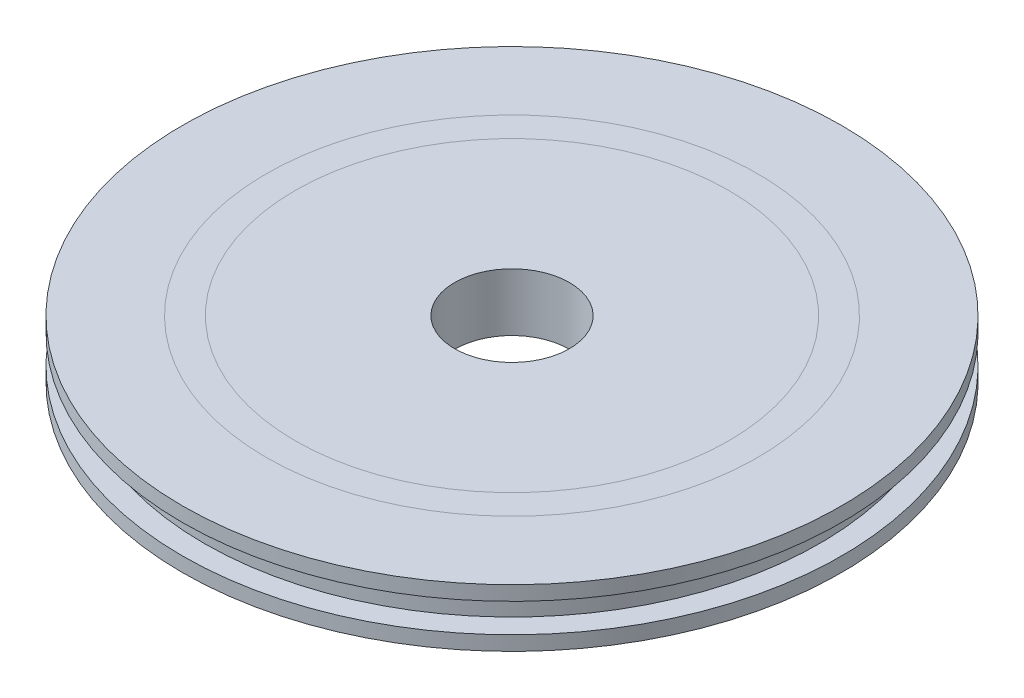
ISO-10303-21;
HEADER;
FILE_DESCRIPTION(('STEP AP214'),'2;1');
FILE_NAME('part.step','',(''),(''),'','','');
FILE_SCHEMA(('AUTOMOTIVE_DESIGN { 1 0 10303 214 1 1 1 1 }'));
ENDSEC;
DATA;
#1=APPLICATION_CONTEXT('core data for automotive mechanical design processes');
#2=APPLICATION_PROTOCOL_DEFINITION('international standard','automotive_design',2000,#1);
#3=PRODUCT_CONTEXT('',#1,'mechanical');
#4=PRODUCT('Part','Part','',(#3));
#5=PRODUCT_RELATED_PRODUCT_CATEGORY('part','',(#4));
#6=PRODUCT_DEFINITION_FORMATION('','',#4);
#7=PRODUCT_DEFINITION_CONTEXT('part definition',#1,'design');
#8=PRODUCT_DEFINITION('design','',#6,#7);
#9=PRODUCT_DEFINITION_SHAPE('','',#8);
#10=(LENGTH_UNIT() NAMED_UNIT(*) SI_UNIT(.MILLI.,.METRE.));
#11=(NAMED_UNIT(*) PLANE_ANGLE_UNIT() SI_UNIT($,.RADIAN.));
#12=(NAMED_UNIT(*) SI_UNIT($,.STERADIAN.) SOLID_ANGLE_UNIT());
#13=UNCERTAINTY_MEASURE_WITH_UNIT(LENGTH_MEASURE(1.E-05),#10,'distance_accuracy_value','');
#14=(GEOMETRIC_REPRESENTATION_CONTEXT(3) GLOBAL_UNCERTAINTY_ASSIGNED_CONTEXT((#13)) GLOBAL_UNIT_ASSIGNED_CONTEXT((#10,
#11,#12)) REPRESENTATION_CONTEXT('',''));
#15=CARTESIAN_POINT('',(0.,0.,0.));
#16=DIRECTION('',(0.,0.,1.));
#17=DIRECTION('',(1.,0.,0.));
#18=AXIS2_PLACEMENT_3D('',#15,#16,#17);
#19=CARTESIAN_POINT('',(0.,0.,28.956));
#20=DIRECTION('',(0.,1.,0.));
#21=DIRECTION('',(0.,0.,1.));
#22=AXIS2_PLACEMENT_3D('',#19,#20,#21);
#23=PLANE('',#22);
#24=CARTESIAN_POINT('',(0.,0.,0.));
#25=DIRECTION('',(0.,1.,0.));
#26=DIRECTION('',(0.,0.,1.));
#27=AXIS2_PLACEMENT_3D('',#24,#25,#26);
#28=CIRCLE('',#27,28.956);
#29=CARTESIAN_POINT('',(0.,0.,28.956));
#30=VERTEX_POINT('',#29);
#31=EDGE_CURVE('E85',#30,#30,#28,.T.);
#32=ORIENTED_EDGE('',*,*,#31,.T.);
#33=EDGE_LOOP('',(#32));
#34=FACE_BOUND('',#33,.T.);
#35=CARTESIAN_POINT('',(0.,0.,0.));
#36=DIRECTION('',(0.,1.,0.));
#37=DIRECTION('',(0.,0.,1.));
#38=AXIS2_PLACEMENT_3D('',#35,#36,#37);
#39=CIRCLE('',#38,21.59);
#40=CARTESIAN_POINT('',(0.,0.,21.59));
#41=VERTEX_POINT('',#40);
#42=EDGE_CURVE('E10',#41,#41,#39,.F.);
#43=ORIENTED_EDGE('',*,*,#42,.T.);
#44=EDGE_LOOP('',(#43));
#45=FACE_BOUND('',#44,.T.);
#46=ADVANCED_FACE('F45',(#34,#45),#23,.T.);
#47=ORIENTED_EDGE('',*,*,#42,.F.);
#48=EDGE_LOOP('',(#47));
#49=FACE_BOUND('',#48,.T.);
#50=CARTESIAN_POINT('',(0.,0.,0.));
#51=DIRECTION('',(0.,1.,0.));
#52=DIRECTION('',(0.,0.,1.));
#53=AXIS2_PLACEMENT_3D('',#50,#51,#52);
#54=CIRCLE('',#53,19.05);
#55=CARTESIAN_POINT('',(0.,0.,19.05));
#56=VERTEX_POINT('',#55);
#57=EDGE_CURVE('E53',#56,#56,#54,.F.);
#58=ORIENTED_EDGE('',*,*,#57,.T.);
#59=EDGE_LOOP('',(#58));
#60=FACE_BOUND('',#59,.T.);
#61=ADVANCED_FACE('F144',(#49,#60),#23,.T.);
#62=CARTESIAN_POINT('',(0.,0.,0.));
#63=DIRECTION('',(0.,-1.,0.));
#64=DIRECTION('',(0.,0.,-1.));
#65=AXIS2_PLACEMENT_3D('',#62,#63,#64);
#66=CIRCLE('',#65,5.0419);
#67=CARTESIAN_POINT('',(0.,0.,-5.0419));
#68=VERTEX_POINT('',#67);
#69=EDGE_CURVE('E89',#68,#68,#66,.T.);
#70=ORIENTED_EDGE('',*,*,#69,.T.);
#71=EDGE_LOOP('',(#70));
#72=FACE_BOUND('',#71,.T.);
#73=ORIENTED_EDGE('',*,*,#57,.F.);
#74=EDGE_LOOP('',(#73));
#75=FACE_BOUND('',#74,.T.);
#76=ADVANCED_FACE('F47',(#72,#75),#23,.T.);
#77=CARTESIAN_POINT('',(0.,-5.08,0.));
#78=DIRECTION('',(0.,-1.,0.));
#79=DIRECTION('',(0.,0.,-1.));
#80=AXIS2_PLACEMENT_3D('',#77,#78,#79);
#81=PLANE('',#80);
#82=CARTESIAN_POINT('',(0.,-5.08,0.));
#83=DIRECTION('',(0.,-1.,0.));
#84=DIRECTION('',(0.,0.,-1.));
#85=AXIS2_PLACEMENT_3D('',#82,#83,#84);
#86=CIRCLE('',#85,5.0419);
#87=CARTESIAN_POINT('',(0.,-5.08,-5.0419));
#88=VERTEX_POINT('',#87);
#89=EDGE_CURVE('E90',#88,#88,#86,.T.);
#90=ORIENTED_EDGE('',*,*,#89,.F.);
#91=EDGE_LOOP('',(#90));
#92=FACE_BOUND('',#91,.T.);
#93=CARTESIAN_POINT('',(0.,-5.08,0.));
#94=DIRECTION('',(0.,1.,0.));
#95=DIRECTION('',(0.,0.,1.));
#96=AXIS2_PLACEMENT_3D('',#93,#94,#95);
#97=CIRCLE('',#96,28.956);
#98=CARTESIAN_POINT('',(0.,-5.08,28.956));
#99=VERTEX_POINT('',#98);
#100=EDGE_CURVE('E60',#99,#99,#97,.T.);
#101=ORIENTED_EDGE('',*,*,#100,.F.);
#102=EDGE_LOOP('',(#101));
#103=FACE_BOUND('',#102,.T.);
#104=ADVANCED_FACE('F109',(#92,#103),#81,.T.);
#105=CARTESIAN_POINT('',(0.,0.,0.));
#106=DIRECTION('',(0.,1.,0.));
#107=DIRECTION('',(0.,0.,1.));
#108=AXIS2_PLACEMENT_3D('',#105,#106,#107);
#109=CYLINDRICAL_SURFACE('',#108,28.9559999999895);
#110=ORIENTED_EDGE('',*,*,#100,.T.);
#111=EDGE_LOOP('',(#110));
#112=FACE_BOUND('',#111,.T.);
#113=CARTESIAN_POINT('',(0.,-3.81,0.));
#114=DIRECTION('',(0.,1.,0.));
#115=DIRECTION('',(0.,0.,1.));
#116=AXIS2_PLACEMENT_3D('',#113,#114,#115);
#117=CIRCLE('',#116,28.9559999999791);
#118=CARTESIAN_POINT('',(0.,-3.81,28.9559999999791));
#119=VERTEX_POINT('',#118);
#120=EDGE_CURVE('E67',#119,#119,#117,.T.);
#121=ORIENTED_EDGE('',*,*,#120,.F.);
#122=EDGE_LOOP('',(#121));
#123=FACE_BOUND('',#122,.T.);
#124=ADVANCED_FACE('F112',(#112,#123),#109,.T.);
#125=CARTESIAN_POINT('',(0.,-3.81,28.9559999999791));
#126=DIRECTION('',(0.,1.,0.));
#127=DIRECTION('',(0.,0.,1.));
#128=AXIS2_PLACEMENT_3D('',#125,#126,#127);
#129=PLANE('',#128);
#130=ORIENTED_EDGE('',*,*,#120,.T.);
#131=EDGE_LOOP('',(#130));
#132=FACE_BOUND('',#131,.T.);
#133=CARTESIAN_POINT('',(0.,-3.81,0.));
#134=DIRECTION('',(0.,1.,0.));
#135=DIRECTION('',(0.,0.,1.));
#136=AXIS2_PLACEMENT_3D('',#133,#134,#135);
#137=CIRCLE('',#136,27.051);
#138=CARTESIAN_POINT('',(0.,-3.81,27.051));
#139=VERTEX_POINT('',#138);
#140=EDGE_CURVE('E73',#139,#139,#137,.T.);
#141=ORIENTED_EDGE('',*,*,#140,.F.);
#142=EDGE_LOOP('',(#141));
#143=FACE_BOUND('',#142,.T.);
#144=ADVANCED_FACE('F117',(#132,#143),#129,.T.);
#145=CARTESIAN_POINT('',(0.,0.,0.));
#146=DIRECTION('',(0.,1.,0.));
#147=DIRECTION('',(0.,0.,1.));
#148=AXIS2_PLACEMENT_3D('',#145,#146,#147);
#149=CYLINDRICAL_SURFACE('',#148,27.051);
#150=ORIENTED_EDGE('',*,*,#140,.T.);
#151=EDGE_LOOP('',(#150));
#152=FACE_BOUND('',#151,.T.);
#153=CARTESIAN_POINT('',(0.,-1.27,0.));
#154=DIRECTION('',(0.,1.,0.));
#155=DIRECTION('',(0.,0.,1.));
#156=AXIS2_PLACEMENT_3D('',#153,#154,#155);
#157=CIRCLE('',#156,27.051);
#158=CARTESIAN_POINT('',(0.,-1.27,27.051));
#159=VERTEX_POINT('',#158);
#160=EDGE_CURVE('E77',#159,#159,#157,.T.);
#161=ORIENTED_EDGE('',*,*,#160,.F.);
#162=EDGE_LOOP('',(#161));
#163=FACE_BOUND('',#162,.T.);
#164=ADVANCED_FACE('F123',(#152,#163),#149,.T.);
#165=CARTESIAN_POINT('',(0.,-1.27,27.051));
#166=DIRECTION('',(0.,-1.,0.));
#167=DIRECTION('',(0.,0.,-1.));
#168=AXIS2_PLACEMENT_3D('',#165,#166,#167);
#169=PLANE('',#168);
#170=ORIENTED_EDGE('',*,*,#160,.T.);
#171=EDGE_LOOP('',(#170));
#172=FACE_BOUND('',#171,.T.);
#173=CARTESIAN_POINT('',(0.,-1.27,0.));
#174=DIRECTION('',(0.,1.,0.));
#175=DIRECTION('',(0.,0.,1.));
#176=AXIS2_PLACEMENT_3D('',#173,#174,#175);
#177=CIRCLE('',#176,28.9559999999791);
#178=CARTESIAN_POINT('',(0.,-1.27,28.9559999999791));
#179=VERTEX_POINT('',#178);
#180=EDGE_CURVE('E81',#179,#179,#177,.T.);
#181=ORIENTED_EDGE('',*,*,#180,.F.);
#182=EDGE_LOOP('',(#181));
#183=FACE_BOUND('',#182,.T.);
#184=ADVANCED_FACE('F129',(#172,#183),#169,.T.);
#185=CARTESIAN_POINT('',(0.,0.,0.));
#186=DIRECTION('',(0.,1.,0.));
#187=DIRECTION('',(0.,0.,1.));
#188=AXIS2_PLACEMENT_3D('',#185,#186,#187);
#189=CYLINDRICAL_SURFACE('',#188,28.9559999999895);
#190=ORIENTED_EDGE('',*,*,#180,.T.);
#191=EDGE_LOOP('',(#190));
#192=FACE_BOUND('',#191,.T.);
#193=ORIENTED_EDGE('',*,*,#31,.F.);
#194=EDGE_LOOP('',(#193));
#195=FACE_BOUND('',#194,.T.);
#196=ADVANCED_FACE('F105',(#192,#195),#189,.T.);
#197=CARTESIAN_POINT('',(0.,0.,0.));
#198=DIRECTION('',(0.,-1.,0.));
#199=DIRECTION('',(0.,0.,-1.));
#200=AXIS2_PLACEMENT_3D('',#197,#198,#199);
#201=CYLINDRICAL_SURFACE('',#200,5.0419);
#202=ORIENTED_EDGE('',*,*,#69,.F.);
#203=EDGE_LOOP('',(#202));
#204=FACE_BOUND('',#203,.T.);
#205=ORIENTED_EDGE('',*,*,#89,.T.);
#206=EDGE_LOOP('',(#205));
#207=FACE_BOUND('',#206,.T.);
#208=ADVANCED_FACE('F102',(#204,#207),#201,.F.);
#209=CLOSED_SHELL('',(#46,#61,#76,#104,#124,#144,#164,#184,#196,#208));
#210=MANIFOLD_SOLID_BREP('B2',#209);
#211=ADVANCED_BREP_SHAPE_REPRESENTATION('',(#18,#210),#14);
#212=SHAPE_DEFINITION_REPRESENTATION(#9,#211);
ENDSEC;
END-ISO-10303-21;
